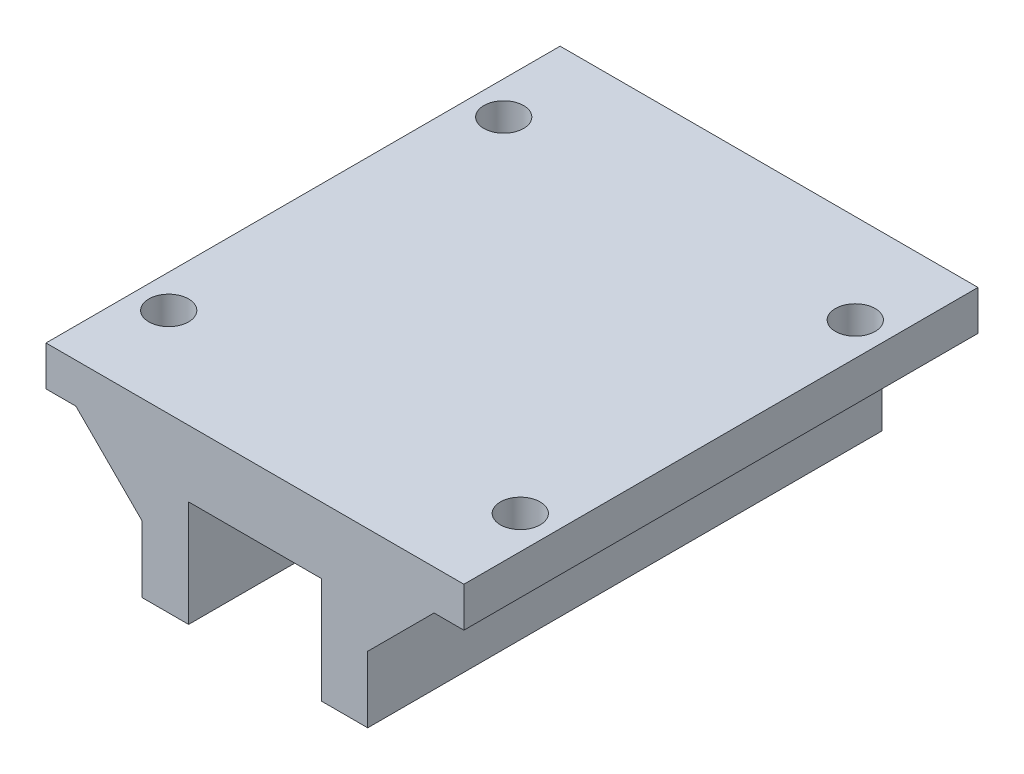
ISO-10303-21;
HEADER;
FILE_DESCRIPTION(('STEP AP214'),'2;1');
FILE_NAME('part.step','',(''),(''),'','','');
FILE_SCHEMA(('AUTOMOTIVE_DESIGN { 1 0 10303 214 1 1 1 1 }'));
ENDSEC;
DATA;
#1=APPLICATION_CONTEXT('core data for automotive mechanical design processes');
#2=APPLICATION_PROTOCOL_DEFINITION('international standard','automotive_design',2000,#1);
#3=PRODUCT_CONTEXT('',#1,'mechanical');
#4=PRODUCT('Part','Part','',(#3));
#5=PRODUCT_RELATED_PRODUCT_CATEGORY('part','',(#4));
#6=PRODUCT_DEFINITION_FORMATION('','',#4);
#7=PRODUCT_DEFINITION_CONTEXT('part definition',#1,'design');
#8=PRODUCT_DEFINITION('design','',#6,#7);
#9=PRODUCT_DEFINITION_SHAPE('','',#8);
#10=(LENGTH_UNIT() NAMED_UNIT(*) SI_UNIT(.MILLI.,.METRE.));
#11=(NAMED_UNIT(*) PLANE_ANGLE_UNIT() SI_UNIT($,.RADIAN.));
#12=(NAMED_UNIT(*) SI_UNIT($,.STERADIAN.) SOLID_ANGLE_UNIT());
#13=UNCERTAINTY_MEASURE_WITH_UNIT(LENGTH_MEASURE(1.E-05),#10,'distance_accuracy_value','');
#14=(GEOMETRIC_REPRESENTATION_CONTEXT(3) GLOBAL_UNCERTAINTY_ASSIGNED_CONTEXT((#13)) GLOBAL_UNIT_ASSIGNED_CONTEXT((#10,
#11,#12)) REPRESENTATION_CONTEXT('',''));
#15=CARTESIAN_POINT('',(0.,0.,0.));
#16=DIRECTION('',(0.,0.,1.));
#17=DIRECTION('',(1.,0.,0.));
#18=AXIS2_PLACEMENT_3D('',#15,#16,#17);
#19=CARTESIAN_POINT('',(-33.0460215845307,11.492125984252,77.5));
#20=DIRECTION('',(1.,0.,0.));
#21=DIRECTION('',(0.,0.,-1.));
#22=AXIS2_PLACEMENT_3D('',#19,#20,#21);
#23=PLANE('',#22);
#24=DIRECTION('',(0.,-1.,0.));
#25=VECTOR('',#24,1.);
#26=CARTESIAN_POINT('',(-33.0460215845307,11.492125984252,0.));
#27=LINE('',#26,#25);
#28=CARTESIAN_POINT('',(-33.0460215845307,17.492125984252,0.));
#29=VERTEX_POINT('',#28);
#30=CARTESIAN_POINT('',(-33.0460215845307,11.492125984252,0.));
#31=VERTEX_POINT('',#30);
#32=EDGE_CURVE('E244',#29,#31,#27,.T.);
#33=ORIENTED_EDGE('',*,*,#32,.T.);
#34=DIRECTION('',(0.,0.,-1.));
#35=VECTOR('',#34,1.);
#36=CARTESIAN_POINT('',(-33.0460215845307,11.492125984252,77.5));
#37=LINE('',#36,#35);
#38=CARTESIAN_POINT('',(-33.0460215845307,11.492125984252,77.5));
#39=VERTEX_POINT('',#38);
#40=EDGE_CURVE('E11',#39,#31,#37,.T.);
#41=ORIENTED_EDGE('',*,*,#40,.F.);
#42=DIRECTION('',(0.,-1.,0.));
#43=VECTOR('',#42,1.);
#44=CARTESIAN_POINT('',(-33.0460215845307,11.492125984252,77.5));
#45=LINE('',#44,#43);
#46=CARTESIAN_POINT('',(-33.0460215845307,17.492125984252,77.5));
#47=VERTEX_POINT('',#46);
#48=EDGE_CURVE('E218',#47,#39,#45,.T.);
#49=ORIENTED_EDGE('',*,*,#48,.F.);
#50=DIRECTION('',(0.,0.,-1.));
#51=VECTOR('',#50,1.);
#52=CARTESIAN_POINT('',(-33.0460215845307,17.492125984252,77.5));
#53=LINE('',#52,#51);
#54=EDGE_CURVE('E212',#47,#29,#53,.T.);
#55=ORIENTED_EDGE('',*,*,#54,.T.);
#56=EDGE_LOOP('',(#33,#41,#49,#55));
#57=FACE_BOUND('',#56,.T.);
#58=ADVANCED_FACE('F37',(#57),#23,.F.);
#59=CARTESIAN_POINT('',(-28.5460215845307,11.492125984252,77.5));
#60=DIRECTION('',(0.,1.,0.));
#61=DIRECTION('',(0.,0.,1.));
#62=AXIS2_PLACEMENT_3D('',#59,#60,#61);
#63=PLANE('',#62);
#64=DIRECTION('',(0.,0.,-1.));
#65=VECTOR('',#64,1.);
#66=CARTESIAN_POINT('',(-28.5460215845307,11.492125984252,77.5));
#67=LINE('',#66,#65);
#68=CARTESIAN_POINT('',(-28.5460215845307,11.492125984252,61.0419601084502));
#69=VERTEX_POINT('',#68);
#70=CARTESIAN_POINT('',(-28.5460215845307,11.492125984252,16.4580398915498));
#71=VERTEX_POINT('',#70);
#72=EDGE_CURVE('E168',#69,#71,#67,.T.);
#73=ORIENTED_EDGE('',*,*,#72,.F.);
#74=CARTESIAN_POINT('',(-28.0460215845307,11.492125984252,64.));
#75=DIRECTION('',(0.,1.,0.));
#76=DIRECTION('',(0.,0.,1.));
#77=AXIS2_PLACEMENT_3D('',#74,#75,#76);
#78=CIRCLE('',#77,3.);
#79=CARTESIAN_POINT('',(-28.5460215845307,11.492125984252,66.9580398915498));
#80=VERTEX_POINT('',#79);
#81=EDGE_CURVE('E57',#69,#80,#78,.T.);
#82=ORIENTED_EDGE('',*,*,#81,.T.);
#83=CARTESIAN_POINT('',(-28.5460215845307,11.492125984252,77.5));
#84=VERTEX_POINT('',#83);
#85=EDGE_CURVE('E44',#84,#80,#67,.T.);
#86=ORIENTED_EDGE('',*,*,#85,.F.);
#87=DIRECTION('',(1.,0.,0.));
#88=VECTOR('',#87,1.);
#89=CARTESIAN_POINT('',(-28.5460215845307,11.492125984252,77.5));
#90=LINE('',#89,#88);
#91=EDGE_CURVE('E271',#39,#84,#90,.T.);
#92=ORIENTED_EDGE('',*,*,#91,.F.);
#93=ORIENTED_EDGE('',*,*,#40,.T.);
#94=DIRECTION('',(1.,0.,0.));
#95=VECTOR('',#94,1.);
#96=CARTESIAN_POINT('',(-28.5460215845307,11.492125984252,0.));
#97=LINE('',#96,#95);
#98=CARTESIAN_POINT('',(-28.5460215845307,11.492125984252,0.));
#99=VERTEX_POINT('',#98);
#100=EDGE_CURVE('E242',#31,#99,#97,.T.);
#101=ORIENTED_EDGE('',*,*,#100,.T.);
#102=CARTESIAN_POINT('',(-28.5460215845307,11.492125984252,10.5419601084502));
#103=VERTEX_POINT('',#102);
#104=EDGE_CURVE('E170',#103,#99,#67,.T.);
#105=ORIENTED_EDGE('',*,*,#104,.F.);
#106=CARTESIAN_POINT('',(-28.0460215845307,11.492125984252,13.5));
#107=DIRECTION('',(0.,1.,0.));
#108=DIRECTION('',(0.,0.,1.));
#109=AXIS2_PLACEMENT_3D('',#106,#107,#108);
#110=CIRCLE('',#109,3.);
#111=EDGE_CURVE('E50',#103,#71,#110,.T.);
#112=ORIENTED_EDGE('',*,*,#111,.T.);
#113=EDGE_LOOP('',(#73,#82,#86,#92,#93,#101,#105,#112));
#114=FACE_BOUND('',#113,.T.);
#115=ADVANCED_FACE('F167',(#114),#63,.F.);
#116=CARTESIAN_POINT('',(-18.5460215845307,1.49212598425197,77.5));
#117=DIRECTION('',(0.707106781186547,0.707106781186548,0.));
#118=DIRECTION('',(-0.707106781186548,0.707106781186547,0.));
#119=AXIS2_PLACEMENT_3D('',#116,#117,#118);
#120=PLANE('',#119);
#121=ORIENTED_EDGE('',*,*,#85,.T.);
#122=CARTESIAN_POINT('',(-28.0460215845307,10.992125984252,64.));
#123=DIRECTION('',(0.707106781186547,0.707106781186548,0.));
#124=DIRECTION('',(-0.707106781186548,0.707106781186547,0.));
#125=AXIS2_PLACEMENT_3D('',#122,#123,#124);
#126=ELLIPSE('',#125,4.24264068711928,3.);
#127=EDGE_CURVE('E175',#80,#69,#126,.T.);
#128=ORIENTED_EDGE('',*,*,#127,.T.);
#129=ORIENTED_EDGE('',*,*,#72,.T.);
#130=CARTESIAN_POINT('',(-28.0460215845307,10.992125984252,13.5));
#131=DIRECTION('',(0.707106781186547,0.707106781186548,0.));
#132=DIRECTION('',(-0.707106781186548,0.707106781186547,0.));
#133=AXIS2_PLACEMENT_3D('',#130,#131,#132);
#134=ELLIPSE('',#133,4.24264068711928,3.);
#135=EDGE_CURVE('E158',#71,#103,#134,.T.);
#136=ORIENTED_EDGE('',*,*,#135,.T.);
#137=ORIENTED_EDGE('',*,*,#104,.T.);
#138=DIRECTION('',(0.707106781186548,-0.707106781186547,0.));
#139=VECTOR('',#138,1.);
#140=CARTESIAN_POINT('',(-18.5460215845307,1.49212598425197,0.));
#141=LINE('',#140,#139);
#142=CARTESIAN_POINT('',(-18.5460215845307,1.49212598425197,0.));
#143=VERTEX_POINT('',#142);
#144=EDGE_CURVE('E240',#99,#143,#141,.T.);
#145=ORIENTED_EDGE('',*,*,#144,.T.);
#146=DIRECTION('',(0.,0.,-1.));
#147=VECTOR('',#146,1.);
#148=CARTESIAN_POINT('',(-18.5460215845307,1.49212598425197,77.5));
#149=LINE('',#148,#147);
#150=CARTESIAN_POINT('',(-18.5460215845307,1.49212598425197,77.5));
#151=VERTEX_POINT('',#150);
#152=EDGE_CURVE('E176',#151,#143,#149,.T.);
#153=ORIENTED_EDGE('',*,*,#152,.F.);
#154=DIRECTION('',(0.707106781186548,-0.707106781186547,0.));
#155=VECTOR('',#154,1.);
#156=CARTESIAN_POINT('',(-18.5460215845307,1.49212598425197,77.5));
#157=LINE('',#156,#155);
#158=EDGE_CURVE('E269',#84,#151,#157,.T.);
#159=ORIENTED_EDGE('',*,*,#158,.F.);
#160=EDGE_LOOP('',(#121,#128,#129,#136,#137,#145,#153,#159));
#161=FACE_BOUND('',#160,.T.);
#162=ADVANCED_FACE('F174',(#161),#120,.F.);
#163=CARTESIAN_POINT('',(-18.5460215845307,-8.50787401574803,77.5));
#164=DIRECTION('',(1.,0.,0.));
#165=DIRECTION('',(0.,1.,0.));
#166=AXIS2_PLACEMENT_3D('',#163,#164,#165);
#167=PLANE('',#166);
#168=DIRECTION('',(0.,-1.,0.));
#169=VECTOR('',#168,1.);
#170=CARTESIAN_POINT('',(-18.5460215845307,-8.50787401574803,0.));
#171=LINE('',#170,#169);
#172=CARTESIAN_POINT('',(-18.5460215845307,-8.50787401574803,0.));
#173=VERTEX_POINT('',#172);
#174=EDGE_CURVE('E238',#143,#173,#171,.T.);
#175=ORIENTED_EDGE('',*,*,#174,.T.);
#176=DIRECTION('',(0.,0.,-1.));
#177=VECTOR('',#176,1.);
#178=CARTESIAN_POINT('',(-18.5460215845307,-8.50787401574803,77.5));
#179=LINE('',#178,#177);
#180=CARTESIAN_POINT('',(-18.5460215845307,-8.50787401574803,77.5));
#181=VERTEX_POINT('',#180);
#182=EDGE_CURVE('E180',#181,#173,#179,.T.);
#183=ORIENTED_EDGE('',*,*,#182,.F.);
#184=DIRECTION('',(0.,-1.,0.));
#185=VECTOR('',#184,1.);
#186=CARTESIAN_POINT('',(-18.5460215845307,-8.50787401574803,77.5));
#187=LINE('',#186,#185);
#188=EDGE_CURVE('E267',#151,#181,#187,.T.);
#189=ORIENTED_EDGE('',*,*,#188,.F.);
#190=ORIENTED_EDGE('',*,*,#152,.T.);
#191=EDGE_LOOP('',(#175,#183,#189,#190));
#192=FACE_BOUND('',#191,.T.);
#193=ADVANCED_FACE('F374',(#192),#167,.F.);
#194=CARTESIAN_POINT('',(-11.5460215845307,-8.50787401574803,77.5));
#195=DIRECTION('',(0.,1.,0.));
#196=DIRECTION('',(-1.,0.,0.));
#197=AXIS2_PLACEMENT_3D('',#194,#195,#196);
#198=PLANE('',#197);
#199=DIRECTION('',(1.,0.,0.));
#200=VECTOR('',#199,1.);
#201=CARTESIAN_POINT('',(-11.5460215845307,-8.50787401574803,0.));
#202=LINE('',#201,#200);
#203=CARTESIAN_POINT('',(-11.5460215845307,-8.50787401574803,0.));
#204=VERTEX_POINT('',#203);
#205=EDGE_CURVE('E236',#173,#204,#202,.T.);
#206=ORIENTED_EDGE('',*,*,#205,.T.);
#207=DIRECTION('',(0.,0.,-1.));
#208=VECTOR('',#207,1.);
#209=CARTESIAN_POINT('',(-11.5460215845307,-8.50787401574803,77.5));
#210=LINE('',#209,#208);
#211=CARTESIAN_POINT('',(-11.5460215845307,-8.50787401574803,77.5));
#212=VERTEX_POINT('',#211);
#213=EDGE_CURVE('E183',#212,#204,#210,.T.);
#214=ORIENTED_EDGE('',*,*,#213,.F.);
#215=DIRECTION('',(1.,0.,0.));
#216=VECTOR('',#215,1.);
#217=CARTESIAN_POINT('',(-11.5460215845307,-8.50787401574803,77.5));
#218=LINE('',#217,#216);
#219=EDGE_CURVE('E265',#181,#212,#218,.T.);
#220=ORIENTED_EDGE('',*,*,#219,.F.);
#221=ORIENTED_EDGE('',*,*,#182,.T.);
#222=EDGE_LOOP('',(#206,#214,#220,#221));
#223=FACE_BOUND('',#222,.T.);
#224=ADVANCED_FACE('F370',(#223),#198,.F.);
#225=CARTESIAN_POINT('',(-11.5460215845307,7.49212598425197,77.5));
#226=DIRECTION('',(-1.,0.,0.));
#227=DIRECTION('',(0.,-1.,0.));
#228=AXIS2_PLACEMENT_3D('',#225,#226,#227);
#229=PLANE('',#228);
#230=DIRECTION('',(0.,1.,0.));
#231=VECTOR('',#230,1.);
#232=CARTESIAN_POINT('',(-11.5460215845307,7.49212598425197,0.));
#233=LINE('',#232,#231);
#234=CARTESIAN_POINT('',(-11.5460215845307,7.49212598425197,0.));
#235=VERTEX_POINT('',#234);
#236=EDGE_CURVE('E234',#204,#235,#233,.T.);
#237=ORIENTED_EDGE('',*,*,#236,.T.);
#238=DIRECTION('',(0.,0.,-1.));
#239=VECTOR('',#238,1.);
#240=CARTESIAN_POINT('',(-11.5460215845307,7.49212598425197,77.5));
#241=LINE('',#240,#239);
#242=CARTESIAN_POINT('',(-11.5460215845307,7.49212598425197,77.5));
#243=VERTEX_POINT('',#242);
#244=EDGE_CURVE('E186',#243,#235,#241,.T.);
#245=ORIENTED_EDGE('',*,*,#244,.F.);
#246=DIRECTION('',(0.,1.,0.));
#247=VECTOR('',#246,1.);
#248=CARTESIAN_POINT('',(-11.5460215845307,7.49212598425197,77.5));
#249=LINE('',#248,#247);
#250=EDGE_CURVE('E263',#212,#243,#249,.T.);
#251=ORIENTED_EDGE('',*,*,#250,.F.);
#252=ORIENTED_EDGE('',*,*,#213,.T.);
#253=EDGE_LOOP('',(#237,#245,#251,#252));
#254=FACE_BOUND('',#253,.T.);
#255=ADVANCED_FACE('F365',(#254),#229,.F.);
#256=CARTESIAN_POINT('',(8.45397841546933,7.49212598425197,77.5));
#257=DIRECTION('',(0.,1.,0.));
#258=DIRECTION('',(-1.,0.,0.));
#259=AXIS2_PLACEMENT_3D('',#256,#257,#258);
#260=PLANE('',#259);
#261=DIRECTION('',(1.,0.,0.));
#262=VECTOR('',#261,1.);
#263=CARTESIAN_POINT('',(8.45397841546933,7.49212598425197,0.));
#264=LINE('',#263,#262);
#265=CARTESIAN_POINT('',(8.45397841546933,7.49212598425197,0.));
#266=VERTEX_POINT('',#265);
#267=EDGE_CURVE('E232',#235,#266,#264,.T.);
#268=ORIENTED_EDGE('',*,*,#267,.T.);
#269=DIRECTION('',(0.,0.,-1.));
#270=VECTOR('',#269,1.);
#271=CARTESIAN_POINT('',(8.45397841546933,7.49212598425197,77.5));
#272=LINE('',#271,#270);
#273=CARTESIAN_POINT('',(8.45397841546933,7.49212598425197,77.5));
#274=VERTEX_POINT('',#273);
#275=EDGE_CURVE('E189',#274,#266,#272,.T.);
#276=ORIENTED_EDGE('',*,*,#275,.F.);
#277=DIRECTION('',(1.,0.,0.));
#278=VECTOR('',#277,1.);
#279=CARTESIAN_POINT('',(8.45397841546933,7.49212598425197,77.5));
#280=LINE('',#279,#278);
#281=EDGE_CURVE('E261',#243,#274,#280,.T.);
#282=ORIENTED_EDGE('',*,*,#281,.F.);
#283=ORIENTED_EDGE('',*,*,#244,.T.);
#284=EDGE_LOOP('',(#268,#276,#282,#283));
#285=FACE_BOUND('',#284,.T.);
#286=ADVANCED_FACE('F360',(#285),#260,.F.);
#287=CARTESIAN_POINT('',(8.45397841546934,-8.50787401574803,77.5));
#288=DIRECTION('',(1.,0.,0.));
#289=DIRECTION('',(0.,1.,0.));
#290=AXIS2_PLACEMENT_3D('',#287,#288,#289);
#291=PLANE('',#290);
#292=DIRECTION('',(0.,-1.,0.));
#293=VECTOR('',#292,1.);
#294=CARTESIAN_POINT('',(8.45397841546934,-8.50787401574803,0.));
#295=LINE('',#294,#293);
#296=CARTESIAN_POINT('',(8.45397841546934,-8.50787401574803,0.));
#297=VERTEX_POINT('',#296);
#298=EDGE_CURVE('E230',#266,#297,#295,.T.);
#299=ORIENTED_EDGE('',*,*,#298,.T.);
#300=DIRECTION('',(0.,0.,-1.));
#301=VECTOR('',#300,1.);
#302=CARTESIAN_POINT('',(8.45397841546934,-8.50787401574803,77.5));
#303=LINE('',#302,#301);
#304=CARTESIAN_POINT('',(8.45397841546934,-8.50787401574803,77.5));
#305=VERTEX_POINT('',#304);
#306=EDGE_CURVE('E192',#305,#297,#303,.T.);
#307=ORIENTED_EDGE('',*,*,#306,.F.);
#308=DIRECTION('',(0.,-1.,0.));
#309=VECTOR('',#308,1.);
#310=CARTESIAN_POINT('',(8.45397841546934,-8.50787401574803,77.5));
#311=LINE('',#310,#309);
#312=EDGE_CURVE('E259',#274,#305,#311,.T.);
#313=ORIENTED_EDGE('',*,*,#312,.F.);
#314=ORIENTED_EDGE('',*,*,#275,.T.);
#315=EDGE_LOOP('',(#299,#307,#313,#314));
#316=FACE_BOUND('',#315,.T.);
#317=ADVANCED_FACE('F356',(#316),#291,.F.);
#318=CARTESIAN_POINT('',(15.4539784154693,-8.50787401574802,77.5));
#319=DIRECTION('',(0.,1.,0.));
#320=DIRECTION('',(-1.,0.,0.));
#321=AXIS2_PLACEMENT_3D('',#318,#319,#320);
#322=PLANE('',#321);
#323=DIRECTION('',(1.,0.,0.));
#324=VECTOR('',#323,1.);
#325=CARTESIAN_POINT('',(15.4539784154693,-8.50787401574802,0.));
#326=LINE('',#325,#324);
#327=CARTESIAN_POINT('',(15.4539784154693,-8.50787401574802,0.));
#328=VERTEX_POINT('',#327);
#329=EDGE_CURVE('E228',#297,#328,#326,.T.);
#330=ORIENTED_EDGE('',*,*,#329,.T.);
#331=DIRECTION('',(0.,0.,-1.));
#332=VECTOR('',#331,1.);
#333=CARTESIAN_POINT('',(15.4539784154693,-8.50787401574802,77.5));
#334=LINE('',#333,#332);
#335=CARTESIAN_POINT('',(15.4539784154693,-8.50787401574802,77.5));
#336=VERTEX_POINT('',#335);
#337=EDGE_CURVE('E195',#336,#328,#334,.T.);
#338=ORIENTED_EDGE('',*,*,#337,.F.);
#339=DIRECTION('',(1.,0.,0.));
#340=VECTOR('',#339,1.);
#341=CARTESIAN_POINT('',(15.4539784154693,-8.50787401574802,77.5));
#342=LINE('',#341,#340);
#343=EDGE_CURVE('E257',#305,#336,#342,.T.);
#344=ORIENTED_EDGE('',*,*,#343,.F.);
#345=ORIENTED_EDGE('',*,*,#306,.T.);
#346=EDGE_LOOP('',(#330,#338,#344,#345));
#347=FACE_BOUND('',#346,.T.);
#348=ADVANCED_FACE('F351',(#347),#322,.F.);
#349=CARTESIAN_POINT('',(15.4539784154693,1.49212598425197,77.5));
#350=DIRECTION('',(-1.,0.,0.));
#351=DIRECTION('',(0.,-1.,0.));
#352=AXIS2_PLACEMENT_3D('',#349,#350,#351);
#353=PLANE('',#352);
#354=DIRECTION('',(0.,1.,0.));
#355=VECTOR('',#354,1.);
#356=CARTESIAN_POINT('',(15.4539784154693,1.49212598425197,0.));
#357=LINE('',#356,#355);
#358=CARTESIAN_POINT('',(15.4539784154693,1.49212598425197,0.));
#359=VERTEX_POINT('',#358);
#360=EDGE_CURVE('E226',#328,#359,#357,.T.);
#361=ORIENTED_EDGE('',*,*,#360,.T.);
#362=DIRECTION('',(0.,0.,-1.));
#363=VECTOR('',#362,1.);
#364=CARTESIAN_POINT('',(15.4539784154693,1.49212598425197,77.5));
#365=LINE('',#364,#363);
#366=CARTESIAN_POINT('',(15.4539784154693,1.49212598425197,77.5));
#367=VERTEX_POINT('',#366);
#368=EDGE_CURVE('E198',#367,#359,#365,.T.);
#369=ORIENTED_EDGE('',*,*,#368,.F.);
#370=DIRECTION('',(0.,1.,0.));
#371=VECTOR('',#370,1.);
#372=CARTESIAN_POINT('',(15.4539784154693,1.49212598425197,77.5));
#373=LINE('',#372,#371);
#374=EDGE_CURVE('E255',#336,#367,#373,.T.);
#375=ORIENTED_EDGE('',*,*,#374,.F.);
#376=ORIENTED_EDGE('',*,*,#337,.T.);
#377=EDGE_LOOP('',(#361,#369,#375,#376));
#378=FACE_BOUND('',#377,.T.);
#379=ADVANCED_FACE('F345',(#378),#353,.F.);
#380=CARTESIAN_POINT('',(25.4539784154693,11.492125984252,77.5));
#381=DIRECTION('',(-0.707106781186548,0.707106781186547,0.));
#382=DIRECTION('',(-0.707106781186547,-0.707106781186548,0.));
#383=AXIS2_PLACEMENT_3D('',#380,#381,#382);
#384=PLANE('',#383);
#385=DIRECTION('',(0.,0.,-1.));
#386=VECTOR('',#385,1.);
#387=CARTESIAN_POINT('',(25.4539784154693,11.492125984252,77.5));
#388=LINE('',#387,#386);
#389=CARTESIAN_POINT('',(25.4539784154693,11.492125984252,10.5419601084502));
#390=VERTEX_POINT('',#389);
#391=CARTESIAN_POINT('',(25.4539784154693,11.492125984252,0.));
#392=VERTEX_POINT('',#391);
#393=EDGE_CURVE('E205',#390,#392,#388,.T.);
#394=ORIENTED_EDGE('',*,*,#393,.F.);
#395=CARTESIAN_POINT('',(24.9539784154693,10.992125984252,13.5));
#396=DIRECTION('',(-0.707106781186548,0.707106781186547,0.));
#397=DIRECTION('',(0.707106781186547,0.707106781186548,0.));
#398=AXIS2_PLACEMENT_3D('',#395,#396,#397);
#399=ELLIPSE('',#398,4.24264068711929,3.);
#400=CARTESIAN_POINT('',(25.4539784154693,11.492125984252,16.4580398915498));
#401=VERTEX_POINT('',#400);
#402=EDGE_CURVE('E247',#390,#401,#399,.T.);
#403=ORIENTED_EDGE('',*,*,#402,.T.);
#404=CARTESIAN_POINT('',(25.4539784154693,11.492125984252,61.0419601084502));
#405=VERTEX_POINT('',#404);
#406=EDGE_CURVE('E204',#405,#401,#388,.T.);
#407=ORIENTED_EDGE('',*,*,#406,.F.);
#408=CARTESIAN_POINT('',(24.9539784154693,10.992125984252,64.));
#409=DIRECTION('',(-0.707106781186548,0.707106781186547,0.));
#410=DIRECTION('',(0.707106781186547,0.707106781186548,0.));
#411=AXIS2_PLACEMENT_3D('',#408,#409,#410);
#412=ELLIPSE('',#411,4.24264068711929,3.);
#413=CARTESIAN_POINT('',(25.4539784154693,11.492125984252,66.9580398915498));
#414=VERTEX_POINT('',#413);
#415=EDGE_CURVE('E282',#405,#414,#412,.T.);
#416=ORIENTED_EDGE('',*,*,#415,.T.);
#417=CARTESIAN_POINT('',(25.4539784154693,11.492125984252,77.5));
#418=VERTEX_POINT('',#417);
#419=EDGE_CURVE('E201',#418,#414,#388,.T.);
#420=ORIENTED_EDGE('',*,*,#419,.F.);
#421=DIRECTION('',(0.707106781186547,0.707106781186548,0.));
#422=VECTOR('',#421,1.);
#423=CARTESIAN_POINT('',(25.4539784154693,11.492125984252,77.5));
#424=LINE('',#423,#422);
#425=EDGE_CURVE('E253',#367,#418,#424,.T.);
#426=ORIENTED_EDGE('',*,*,#425,.F.);
#427=ORIENTED_EDGE('',*,*,#368,.T.);
#428=DIRECTION('',(0.707106781186547,0.707106781186548,0.));
#429=VECTOR('',#428,1.);
#430=CARTESIAN_POINT('',(25.4539784154693,11.492125984252,0.));
#431=LINE('',#430,#429);
#432=EDGE_CURVE('E223',#359,#392,#431,.T.);
#433=ORIENTED_EDGE('',*,*,#432,.T.);
#434=EDGE_LOOP('',(#394,#403,#407,#416,#420,#426,#427,#433));
#435=FACE_BOUND('',#434,.T.);
#436=ADVANCED_FACE('F339',(#435),#384,.F.);
#437=CARTESIAN_POINT('',(29.9539784154693,11.492125984252,77.5));
#438=DIRECTION('',(0.,1.,0.));
#439=DIRECTION('',(0.,0.,1.));
#440=AXIS2_PLACEMENT_3D('',#437,#438,#439);
#441=PLANE('',#440);
#442=ORIENTED_EDGE('',*,*,#406,.T.);
#443=CARTESIAN_POINT('',(24.9539784154693,11.492125984252,13.5));
#444=DIRECTION('',(0.,1.,0.));
#445=DIRECTION('',(0.,0.,1.));
#446=AXIS2_PLACEMENT_3D('',#443,#444,#445);
#447=CIRCLE('',#446,3.);
#448=EDGE_CURVE('E277',#401,#390,#447,.T.);
#449=ORIENTED_EDGE('',*,*,#448,.T.);
#450=ORIENTED_EDGE('',*,*,#393,.T.);
#451=DIRECTION('',(1.,0.,0.));
#452=VECTOR('',#451,1.);
#453=CARTESIAN_POINT('',(29.9539784154693,11.492125984252,0.));
#454=LINE('',#453,#452);
#455=CARTESIAN_POINT('',(29.9539784154693,11.492125984252,0.));
#456=VERTEX_POINT('',#455);
#457=EDGE_CURVE('E221',#392,#456,#454,.T.);
#458=ORIENTED_EDGE('',*,*,#457,.T.);
#459=DIRECTION('',(0.,0.,-1.));
#460=VECTOR('',#459,1.);
#461=CARTESIAN_POINT('',(29.9539784154693,11.492125984252,77.5));
#462=LINE('',#461,#460);
#463=CARTESIAN_POINT('',(29.9539784154693,11.492125984252,77.5));
#464=VERTEX_POINT('',#463);
#465=EDGE_CURVE('E206',#464,#456,#462,.T.);
#466=ORIENTED_EDGE('',*,*,#465,.F.);
#467=DIRECTION('',(1.,0.,0.));
#468=VECTOR('',#467,1.);
#469=CARTESIAN_POINT('',(29.9539784154693,11.492125984252,77.5));
#470=LINE('',#469,#468);
#471=EDGE_CURVE('E251',#418,#464,#470,.T.);
#472=ORIENTED_EDGE('',*,*,#471,.F.);
#473=ORIENTED_EDGE('',*,*,#419,.T.);
#474=CARTESIAN_POINT('',(24.9539784154693,11.492125984252,64.));
#475=DIRECTION('',(0.,1.,0.));
#476=DIRECTION('',(0.,0.,1.));
#477=AXIS2_PLACEMENT_3D('',#474,#475,#476);
#478=CIRCLE('',#477,3.);
#479=EDGE_CURVE('E171',#414,#405,#478,.T.);
#480=ORIENTED_EDGE('',*,*,#479,.T.);
#481=EDGE_LOOP('',(#442,#449,#450,#458,#466,#472,#473,#480));
#482=FACE_BOUND('',#481,.T.);
#483=ADVANCED_FACE('F336',(#482),#441,.F.);
#484=CARTESIAN_POINT('',(29.9539784154693,17.492125984252,77.5));
#485=DIRECTION('',(-1.,0.,0.));
#486=DIRECTION('',(0.,-1.,0.));
#487=AXIS2_PLACEMENT_3D('',#484,#485,#486);
#488=PLANE('',#487);
#489=DIRECTION('',(0.,1.,0.));
#490=VECTOR('',#489,1.);
#491=CARTESIAN_POINT('',(29.9539784154693,17.492125984252,0.));
#492=LINE('',#491,#490);
#493=CARTESIAN_POINT('',(29.9539784154693,17.492125984252,0.));
#494=VERTEX_POINT('',#493);
#495=EDGE_CURVE('E219',#456,#494,#492,.T.);
#496=ORIENTED_EDGE('',*,*,#495,.T.);
#497=DIRECTION('',(0.,0.,-1.));
#498=VECTOR('',#497,1.);
#499=CARTESIAN_POINT('',(29.9539784154693,17.492125984252,77.5));
#500=LINE('',#499,#498);
#501=CARTESIAN_POINT('',(29.9539784154693,17.492125984252,77.5));
#502=VERTEX_POINT('',#501);
#503=EDGE_CURVE('E209',#502,#494,#500,.T.);
#504=ORIENTED_EDGE('',*,*,#503,.F.);
#505=DIRECTION('',(0.,1.,0.));
#506=VECTOR('',#505,1.);
#507=CARTESIAN_POINT('',(29.9539784154693,17.492125984252,77.5));
#508=LINE('',#507,#506);
#509=EDGE_CURVE('E249',#464,#502,#508,.T.);
#510=ORIENTED_EDGE('',*,*,#509,.F.);
#511=ORIENTED_EDGE('',*,*,#465,.T.);
#512=EDGE_LOOP('',(#496,#504,#510,#511));
#513=FACE_BOUND('',#512,.T.);
#514=ADVANCED_FACE('F306',(#513),#488,.F.);
#515=CARTESIAN_POINT('',(-33.0460215845307,17.492125984252,77.5));
#516=DIRECTION('',(0.,-1.,0.));
#517=DIRECTION('',(0.,0.,-1.));
#518=AXIS2_PLACEMENT_3D('',#515,#516,#517);
#519=PLANE('',#518);
#520=CARTESIAN_POINT('',(24.9539784154693,17.492125984252,13.5));
#521=DIRECTION('',(0.,1.,0.));
#522=DIRECTION('',(0.,0.,1.));
#523=AXIS2_PLACEMENT_3D('',#520,#521,#522);
#524=CIRCLE('',#523,3.);
#525=CARTESIAN_POINT('',(24.9539784154693,17.492125984252,16.5));
#526=VERTEX_POINT('',#525);
#527=EDGE_CURVE('E290',#526,#526,#524,.T.);
#528=ORIENTED_EDGE('',*,*,#527,.F.);
#529=EDGE_LOOP('',(#528));
#530=FACE_BOUND('',#529,.T.);
#531=CARTESIAN_POINT('',(-28.0460215845307,17.492125984252,64.));
#532=DIRECTION('',(0.,1.,0.));
#533=DIRECTION('',(0.,0.,1.));
#534=AXIS2_PLACEMENT_3D('',#531,#532,#533);
#535=CIRCLE('',#534,3.);
#536=CARTESIAN_POINT('',(-28.0460215845307,17.492125984252,67.));
#537=VERTEX_POINT('',#536);
#538=EDGE_CURVE('E293',#537,#537,#535,.T.);
#539=ORIENTED_EDGE('',*,*,#538,.F.);
#540=EDGE_LOOP('',(#539));
#541=FACE_BOUND('',#540,.T.);
#542=CARTESIAN_POINT('',(24.9539784154693,17.492125984252,64.));
#543=DIRECTION('',(0.,1.,0.));
#544=DIRECTION('',(0.,0.,1.));
#545=AXIS2_PLACEMENT_3D('',#542,#543,#544);
#546=CIRCLE('',#545,3.);
#547=CARTESIAN_POINT('',(24.9539784154693,17.492125984252,67.));
#548=VERTEX_POINT('',#547);
#549=EDGE_CURVE('E289',#548,#548,#546,.T.);
#550=ORIENTED_EDGE('',*,*,#549,.F.);
#551=EDGE_LOOP('',(#550));
#552=FACE_BOUND('',#551,.T.);
#553=CARTESIAN_POINT('',(-28.0460215845307,17.492125984252,13.5));
#554=DIRECTION('',(0.,1.,0.));
#555=DIRECTION('',(0.,0.,1.));
#556=AXIS2_PLACEMENT_3D('',#553,#554,#555);
#557=CIRCLE('',#556,3.);
#558=CARTESIAN_POINT('',(-28.0460215845307,17.492125984252,16.5));
#559=VERTEX_POINT('',#558);
#560=EDGE_CURVE('E163',#559,#559,#557,.T.);
#561=ORIENTED_EDGE('',*,*,#560,.F.);
#562=EDGE_LOOP('',(#561));
#563=FACE_BOUND('',#562,.T.);
#564=DIRECTION('',(-1.,0.,0.));
#565=VECTOR('',#564,1.);
#566=CARTESIAN_POINT('',(-33.0460215845307,17.492125984252,0.));
#567=LINE('',#566,#565);
#568=EDGE_CURVE('E216',#494,#29,#567,.T.);
#569=ORIENTED_EDGE('',*,*,#568,.T.);
#570=ORIENTED_EDGE('',*,*,#54,.F.);
#571=DIRECTION('',(-1.,0.,0.));
#572=VECTOR('',#571,1.);
#573=CARTESIAN_POINT('',(-33.0460215845307,17.492125984252,77.5));
#574=LINE('',#573,#572);
#575=EDGE_CURVE('E215',#502,#47,#574,.T.);
#576=ORIENTED_EDGE('',*,*,#575,.F.);
#577=ORIENTED_EDGE('',*,*,#503,.T.);
#578=EDGE_LOOP('',(#569,#570,#576,#577));
#579=FACE_BOUND('',#578,.T.);
#580=ADVANCED_FACE('F302',(#530,#541,#552,#563,#579),#519,.F.);
#581=CARTESIAN_POINT('',(0.,0.,77.5));
#582=DIRECTION('',(0.,0.,-1.));
#583=DIRECTION('',(-1.,0.,0.));
#584=AXIS2_PLACEMENT_3D('',#581,#582,#583);
#585=PLANE('',#584);
#586=ORIENTED_EDGE('',*,*,#48,.T.);
#587=ORIENTED_EDGE('',*,*,#91,.T.);
#588=ORIENTED_EDGE('',*,*,#158,.T.);
#589=ORIENTED_EDGE('',*,*,#188,.T.);
#590=ORIENTED_EDGE('',*,*,#219,.T.);
#591=ORIENTED_EDGE('',*,*,#250,.T.);
#592=ORIENTED_EDGE('',*,*,#281,.T.);
#593=ORIENTED_EDGE('',*,*,#312,.T.);
#594=ORIENTED_EDGE('',*,*,#343,.T.);
#595=ORIENTED_EDGE('',*,*,#374,.T.);
#596=ORIENTED_EDGE('',*,*,#425,.T.);
#597=ORIENTED_EDGE('',*,*,#471,.T.);
#598=ORIENTED_EDGE('',*,*,#509,.T.);
#599=ORIENTED_EDGE('',*,*,#575,.T.);
#600=EDGE_LOOP('',(#586,#587,#588,#589,#590,#591,#592,#593,#594,#595,#596,#597,#598,#599));
#601=FACE_BOUND('',#600,.T.);
#602=ADVANCED_FACE('F305',(#601),#585,.F.);
#603=CARTESIAN_POINT('',(0.,0.,0.));
#604=DIRECTION('',(0.,0.,-1.));
#605=DIRECTION('',(-1.,0.,0.));
#606=AXIS2_PLACEMENT_3D('',#603,#604,#605);
#607=PLANE('',#606);
#608=ORIENTED_EDGE('',*,*,#32,.F.);
#609=ORIENTED_EDGE('',*,*,#568,.F.);
#610=ORIENTED_EDGE('',*,*,#495,.F.);
#611=ORIENTED_EDGE('',*,*,#457,.F.);
#612=ORIENTED_EDGE('',*,*,#432,.F.);
#613=ORIENTED_EDGE('',*,*,#360,.F.);
#614=ORIENTED_EDGE('',*,*,#329,.F.);
#615=ORIENTED_EDGE('',*,*,#298,.F.);
#616=ORIENTED_EDGE('',*,*,#267,.F.);
#617=ORIENTED_EDGE('',*,*,#236,.F.);
#618=ORIENTED_EDGE('',*,*,#205,.F.);
#619=ORIENTED_EDGE('',*,*,#174,.F.);
#620=ORIENTED_EDGE('',*,*,#144,.F.);
#621=ORIENTED_EDGE('',*,*,#100,.F.);
#622=EDGE_LOOP('',(#608,#609,#610,#611,#612,#613,#614,#615,#616,#617,#618,#619,#620,#621));
#623=FACE_BOUND('',#622,.T.);
#624=ADVANCED_FACE('F321',(#623),#607,.T.);
#625=CARTESIAN_POINT('',(-28.0460215845307,-60.007874015748,13.5));
#626=DIRECTION('',(0.,1.,0.));
#627=DIRECTION('',(0.,0.,1.));
#628=AXIS2_PLACEMENT_3D('',#625,#626,#627);
#629=CYLINDRICAL_SURFACE('',#628,3.);
#630=ORIENTED_EDGE('',*,*,#560,.T.);
#631=EDGE_LOOP('',(#630));
#632=FACE_BOUND('',#631,.T.);
#633=ORIENTED_EDGE('',*,*,#135,.F.);
#634=ORIENTED_EDGE('',*,*,#111,.F.);
#635=EDGE_LOOP('',(#633,#634));
#636=FACE_BOUND('',#635,.T.);
#637=ADVANCED_FACE('F159',(#632,#636),#629,.F.);
#638=CARTESIAN_POINT('',(24.9539784154693,-60.007874015748,64.));
#639=DIRECTION('',(0.,1.,0.));
#640=DIRECTION('',(0.,0.,1.));
#641=AXIS2_PLACEMENT_3D('',#638,#639,#640);
#642=CYLINDRICAL_SURFACE('',#641,3.);
#643=ORIENTED_EDGE('',*,*,#549,.T.);
#644=EDGE_LOOP('',(#643));
#645=FACE_BOUND('',#644,.T.);
#646=ORIENTED_EDGE('',*,*,#479,.F.);
#647=ORIENTED_EDGE('',*,*,#415,.F.);
#648=EDGE_LOOP('',(#646,#647));
#649=FACE_BOUND('',#648,.T.);
#650=ADVANCED_FACE('F299',(#645,#649),#642,.F.);
#651=CARTESIAN_POINT('',(-28.0460215845307,-60.007874015748,64.));
#652=DIRECTION('',(0.,1.,0.));
#653=DIRECTION('',(0.,0.,1.));
#654=AXIS2_PLACEMENT_3D('',#651,#652,#653);
#655=CYLINDRICAL_SURFACE('',#654,3.);
#656=ORIENTED_EDGE('',*,*,#538,.T.);
#657=EDGE_LOOP('',(#656));
#658=FACE_BOUND('',#657,.T.);
#659=ORIENTED_EDGE('',*,*,#127,.F.);
#660=ORIENTED_EDGE('',*,*,#81,.F.);
#661=EDGE_LOOP('',(#659,#660));
#662=FACE_BOUND('',#661,.T.);
#663=ADVANCED_FACE('F380',(#658,#662),#655,.F.);
#664=CARTESIAN_POINT('',(24.9539784154693,-60.007874015748,13.5));
#665=DIRECTION('',(0.,1.,0.));
#666=DIRECTION('',(0.,0.,1.));
#667=AXIS2_PLACEMENT_3D('',#664,#665,#666);
#668=CYLINDRICAL_SURFACE('',#667,3.);
#669=ORIENTED_EDGE('',*,*,#527,.T.);
#670=EDGE_LOOP('',(#669));
#671=FACE_BOUND('',#670,.T.);
#672=ORIENTED_EDGE('',*,*,#448,.F.);
#673=ORIENTED_EDGE('',*,*,#402,.F.);
#674=EDGE_LOOP('',(#672,#673));
#675=FACE_BOUND('',#674,.T.);
#676=ADVANCED_FACE('F378',(#671,#675),#668,.F.);
#677=CLOSED_SHELL('',(#58,#115,#162,#193,#224,#255,#286,#317,#348,#379,#436,#483,#514,#580,#602,
#624,#637,#650,#663,#676));
#678=MANIFOLD_SOLID_BREP('B2',#677);
#679=ADVANCED_BREP_SHAPE_REPRESENTATION('',(#18,#678),#14);
#680=SHAPE_DEFINITION_REPRESENTATION(#9,#679);
ENDSEC;
END-ISO-10303-21;
